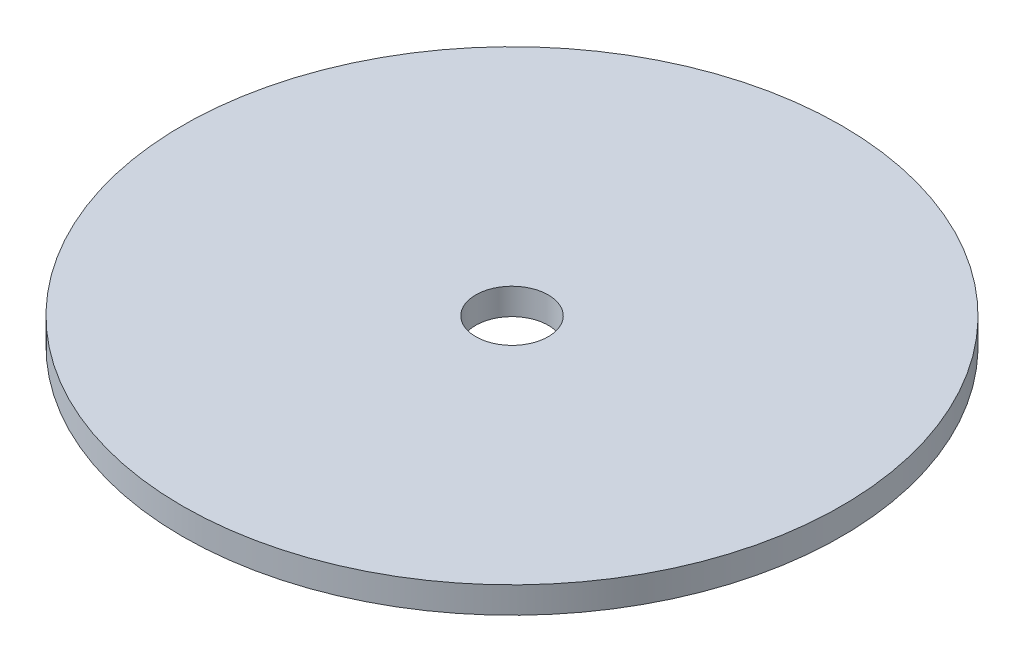
ISO-10303-21;
HEADER;
FILE_DESCRIPTION(('STEP AP214'),'2;1');
FILE_NAME('part.step','',(''),(''),'','','');
FILE_SCHEMA(('AUTOMOTIVE_DESIGN { 1 0 10303 214 1 1 1 1 }'));
ENDSEC;
DATA;
#1=APPLICATION_CONTEXT('core data for automotive mechanical design processes');
#2=APPLICATION_PROTOCOL_DEFINITION('international standard','automotive_design',2000,#1);
#3=PRODUCT_CONTEXT('',#1,'mechanical');
#4=PRODUCT('Part','Part','',(#3));
#5=PRODUCT_RELATED_PRODUCT_CATEGORY('part','',(#4));
#6=PRODUCT_DEFINITION_FORMATION('','',#4);
#7=PRODUCT_DEFINITION_CONTEXT('part definition',#1,'design');
#8=PRODUCT_DEFINITION('design','',#6,#7);
#9=PRODUCT_DEFINITION_SHAPE('','',#8);
#10=(LENGTH_UNIT() NAMED_UNIT(*) SI_UNIT(.MILLI.,.METRE.));
#11=(NAMED_UNIT(*) PLANE_ANGLE_UNIT() SI_UNIT($,.RADIAN.));
#12=(NAMED_UNIT(*) SI_UNIT($,.STERADIAN.) SOLID_ANGLE_UNIT());
#13=UNCERTAINTY_MEASURE_WITH_UNIT(LENGTH_MEASURE(1.E-05),#10,'distance_accuracy_value','');
#14=(GEOMETRIC_REPRESENTATION_CONTEXT(3) GLOBAL_UNCERTAINTY_ASSIGNED_CONTEXT((#13)) GLOBAL_UNIT_ASSIGNED_CONTEXT((#10,
#11,#12)) REPRESENTATION_CONTEXT('',''));
#15=CARTESIAN_POINT('',(0.,0.,0.));
#16=DIRECTION('',(0.,0.,1.));
#17=DIRECTION('',(1.,0.,0.));
#18=AXIS2_PLACEMENT_3D('',#15,#16,#17);
#19=CARTESIAN_POINT('',(0.,3.,0.));
#20=DIRECTION('',(0.,1.,0.));
#21=DIRECTION('',(0.,0.,1.));
#22=AXIS2_PLACEMENT_3D('',#19,#20,#21);
#23=PLANE('',#22);
#24=CARTESIAN_POINT('',(0.,3.,0.));
#25=DIRECTION('',(0.,1.,0.));
#26=DIRECTION('',(0.,0.,1.));
#27=AXIS2_PLACEMENT_3D('',#24,#25,#26);
#28=CIRCLE('',#27,37.5);
#29=CARTESIAN_POINT('',(0.,3.,37.5));
#30=VERTEX_POINT('',#29);
#31=EDGE_CURVE('E10',#30,#30,#28,.T.);
#32=ORIENTED_EDGE('',*,*,#31,.T.);
#33=EDGE_LOOP('',(#32));
#34=FACE_BOUND('',#33,.T.);
#35=CARTESIAN_POINT('',(0.,3.,0.));
#36=DIRECTION('',(0.,1.,0.));
#37=DIRECTION('',(0.,0.,1.));
#38=AXIS2_PLACEMENT_3D('',#35,#36,#37);
#39=CIRCLE('',#38,4.125);
#40=CARTESIAN_POINT('',(0.,3.,4.125));
#41=VERTEX_POINT('',#40);
#42=EDGE_CURVE('E50',#41,#41,#39,.T.);
#43=ORIENTED_EDGE('',*,*,#42,.F.);
#44=EDGE_LOOP('',(#43));
#45=FACE_BOUND('',#44,.T.);
#46=ADVANCED_FACE('F37',(#34,#45),#23,.T.);
#47=CARTESIAN_POINT('',(0.,0.,0.));
#48=DIRECTION('',(0.,1.,0.));
#49=DIRECTION('',(0.,0.,1.));
#50=AXIS2_PLACEMENT_3D('',#47,#48,#49);
#51=PLANE('',#50);
#52=CARTESIAN_POINT('',(0.,0.,0.));
#53=DIRECTION('',(0.,1.,0.));
#54=DIRECTION('',(0.,0.,1.));
#55=AXIS2_PLACEMENT_3D('',#52,#53,#54);
#56=CIRCLE('',#55,37.5);
#57=CARTESIAN_POINT('',(0.,0.,37.5));
#58=VERTEX_POINT('',#57);
#59=EDGE_CURVE('E41',#58,#58,#56,.T.);
#60=ORIENTED_EDGE('',*,*,#59,.F.);
#61=EDGE_LOOP('',(#60));
#62=FACE_BOUND('',#61,.T.);
#63=CARTESIAN_POINT('',(0.,0.,0.));
#64=DIRECTION('',(0.,1.,0.));
#65=DIRECTION('',(0.,0.,1.));
#66=AXIS2_PLACEMENT_3D('',#63,#64,#65);
#67=CIRCLE('',#66,4.125);
#68=CARTESIAN_POINT('',(0.,0.,4.125));
#69=VERTEX_POINT('',#68);
#70=EDGE_CURVE('E52',#69,#69,#67,.T.);
#71=ORIENTED_EDGE('',*,*,#70,.T.);
#72=EDGE_LOOP('',(#71));
#73=FACE_BOUND('',#72,.T.);
#74=ADVANCED_FACE('F64',(#62,#73),#51,.F.);
#75=CARTESIAN_POINT('',(0.,3.,0.));
#76=DIRECTION('',(0.,-1.,0.));
#77=DIRECTION('',(0.,0.,-1.));
#78=AXIS2_PLACEMENT_3D('',#75,#76,#77);
#79=CYLINDRICAL_SURFACE('',#78,37.5);
#80=ORIENTED_EDGE('',*,*,#31,.F.);
#81=EDGE_LOOP('',(#80));
#82=FACE_BOUND('',#81,.T.);
#83=ORIENTED_EDGE('',*,*,#59,.T.);
#84=EDGE_LOOP('',(#83));
#85=FACE_BOUND('',#84,.T.);
#86=ADVANCED_FACE('F39',(#82,#85),#79,.T.);
#87=CARTESIAN_POINT('',(0.,3.,0.));
#88=DIRECTION('',(0.,-1.,0.));
#89=DIRECTION('',(0.,0.,-1.));
#90=AXIS2_PLACEMENT_3D('',#87,#88,#89);
#91=CYLINDRICAL_SURFACE('',#90,4.125);
#92=ORIENTED_EDGE('',*,*,#42,.T.);
#93=EDGE_LOOP('',(#92));
#94=FACE_BOUND('',#93,.T.);
#95=ORIENTED_EDGE('',*,*,#70,.F.);
#96=EDGE_LOOP('',(#95));
#97=FACE_BOUND('',#96,.T.);
#98=ADVANCED_FACE('F60',(#94,#97),#91,.F.);
#99=CLOSED_SHELL('',(#46,#74,#86,#98));
#100=MANIFOLD_SOLID_BREP('B2',#99);
#101=ADVANCED_BREP_SHAPE_REPRESENTATION('',(#18,#100),#14);
#102=SHAPE_DEFINITION_REPRESENTATION(#9,#101);
ENDSEC;
END-ISO-10303-21;
